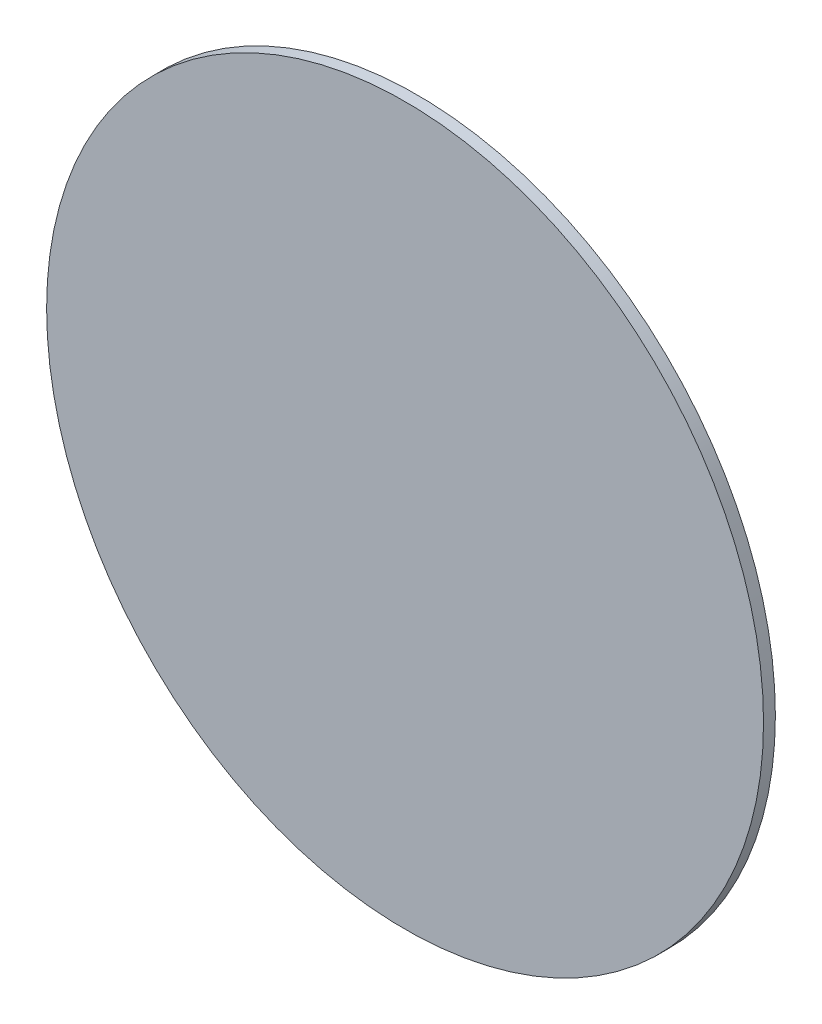
ISO-10303-21;
HEADER;
FILE_DESCRIPTION(('STEP AP214'),'2;1');
FILE_NAME('part.step','',(''),(''),'','','');
FILE_SCHEMA(('AUTOMOTIVE_DESIGN { 1 0 10303 214 1 1 1 1 }'));
ENDSEC;
DATA;
#1=APPLICATION_CONTEXT('core data for automotive mechanical design processes');
#2=APPLICATION_PROTOCOL_DEFINITION('international standard','automotive_design',2000,#1);
#3=PRODUCT_CONTEXT('',#1,'mechanical');
#4=PRODUCT('Part','Part','',(#3));
#5=PRODUCT_RELATED_PRODUCT_CATEGORY('part','',(#4));
#6=PRODUCT_DEFINITION_FORMATION('','',#4);
#7=PRODUCT_DEFINITION_CONTEXT('part definition',#1,'design');
#8=PRODUCT_DEFINITION('design','',#6,#7);
#9=PRODUCT_DEFINITION_SHAPE('','',#8);
#10=(LENGTH_UNIT() NAMED_UNIT(*) SI_UNIT(.MILLI.,.METRE.));
#11=(NAMED_UNIT(*) PLANE_ANGLE_UNIT() SI_UNIT($,.RADIAN.));
#12=(NAMED_UNIT(*) SI_UNIT($,.STERADIAN.) SOLID_ANGLE_UNIT());
#13=UNCERTAINTY_MEASURE_WITH_UNIT(LENGTH_MEASURE(1.E-05),#10,'distance_accuracy_value','');
#14=(GEOMETRIC_REPRESENTATION_CONTEXT(3) GLOBAL_UNCERTAINTY_ASSIGNED_CONTEXT((#13)) GLOBAL_UNIT_ASSIGNED_CONTEXT((#10,
#11,#12)) REPRESENTATION_CONTEXT('',''));
#15=CARTESIAN_POINT('',(0.,0.,0.));
#16=DIRECTION('',(0.,0.,1.));
#17=DIRECTION('',(1.,0.,0.));
#18=AXIS2_PLACEMENT_3D('',#15,#16,#17);
#19=CARTESIAN_POINT('',(0.,0.,2.));
#20=DIRECTION('',(0.,0.,-1.));
#21=DIRECTION('',(-1.,0.,0.));
#22=AXIS2_PLACEMENT_3D('',#19,#20,#21);
#23=CYLINDRICAL_SURFACE('',#22,60.5);
#24=CARTESIAN_POINT('',(0.,0.,2.));
#25=DIRECTION('',(0.,0.,1.));
#26=DIRECTION('',(1.,0.,0.));
#27=AXIS2_PLACEMENT_3D('',#24,#25,#26);
#28=CIRCLE('',#27,60.5);
#29=CARTESIAN_POINT('',(60.5,0.,2.));
#30=VERTEX_POINT('',#29);
#31=EDGE_CURVE('E10',#30,#30,#28,.T.);
#32=ORIENTED_EDGE('',*,*,#31,.F.);
#33=EDGE_LOOP('',(#32));
#34=FACE_BOUND('',#33,.T.);
#35=CARTESIAN_POINT('',(0.,0.,0.));
#36=DIRECTION('',(0.,0.,1.));
#37=DIRECTION('',(1.,0.,0.));
#38=AXIS2_PLACEMENT_3D('',#35,#36,#37);
#39=CIRCLE('',#38,60.5);
#40=CARTESIAN_POINT('',(60.5,0.,0.));
#41=VERTEX_POINT('',#40);
#42=EDGE_CURVE('E33',#41,#41,#39,.T.);
#43=ORIENTED_EDGE('',*,*,#42,.T.);
#44=EDGE_LOOP('',(#43));
#45=FACE_BOUND('',#44,.T.);
#46=ADVANCED_FACE('F30',(#34,#45),#23,.T.);
#47=CARTESIAN_POINT('',(0.,0.,2.));
#48=DIRECTION('',(0.,0.,1.));
#49=DIRECTION('',(1.,0.,0.));
#50=AXIS2_PLACEMENT_3D('',#47,#48,#49);
#51=PLANE('',#50);
#52=ORIENTED_EDGE('',*,*,#31,.T.);
#53=EDGE_LOOP('',(#52));
#54=FACE_BOUND('',#53,.T.);
#55=ADVANCED_FACE('F45',(#54),#51,.T.);
#56=CARTESIAN_POINT('',(0.,0.,0.));
#57=DIRECTION('',(0.,0.,1.));
#58=DIRECTION('',(1.,0.,0.));
#59=AXIS2_PLACEMENT_3D('',#56,#57,#58);
#60=PLANE('',#59);
#61=ORIENTED_EDGE('',*,*,#42,.F.);
#62=EDGE_LOOP('',(#61));
#63=FACE_BOUND('',#62,.T.);
#64=ADVANCED_FACE('F43',(#63),#60,.F.);
#65=CLOSED_SHELL('',(#46,#55,#64));
#66=MANIFOLD_SOLID_BREP('B2',#65);
#67=ADVANCED_BREP_SHAPE_REPRESENTATION('',(#18,#66),#14);
#68=SHAPE_DEFINITION_REPRESENTATION(#9,#67);
ENDSEC;
END-ISO-10303-21;
